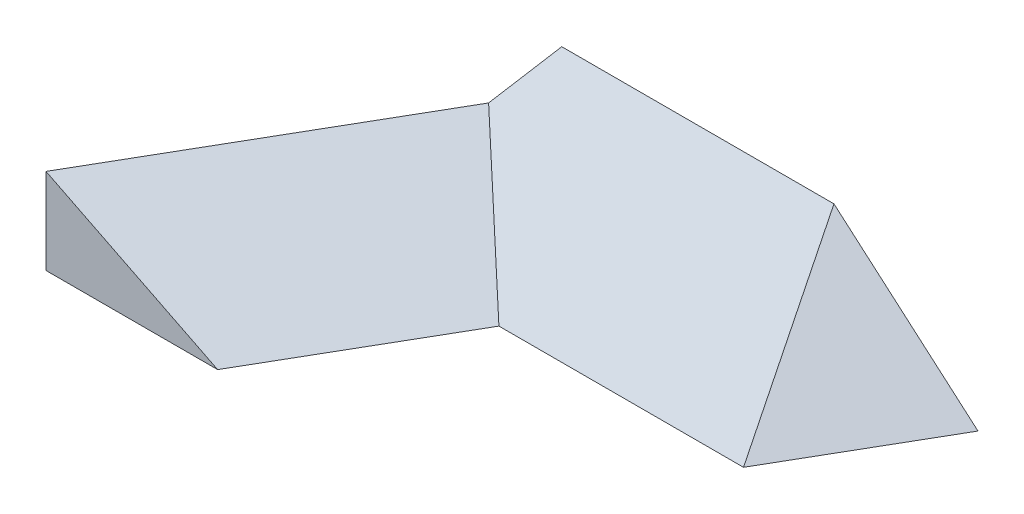
ISO-10303-21;
HEADER;
FILE_DESCRIPTION(('STEP AP214'),'2;1');
FILE_NAME('part.step','',(''),(''),'','','');
FILE_SCHEMA(('AUTOMOTIVE_DESIGN { 1 0 10303 214 1 1 1 1 }'));
ENDSEC;
DATA;
#1=APPLICATION_CONTEXT('core data for automotive mechanical design processes');
#2=APPLICATION_PROTOCOL_DEFINITION('international standard','automotive_design',2000,#1);
#3=PRODUCT_CONTEXT('',#1,'mechanical');
#4=PRODUCT('Part','Part','',(#3));
#5=PRODUCT_RELATED_PRODUCT_CATEGORY('part','',(#4));
#6=PRODUCT_DEFINITION_FORMATION('','',#4);
#7=PRODUCT_DEFINITION_CONTEXT('part definition',#1,'design');
#8=PRODUCT_DEFINITION('design','',#6,#7);
#9=PRODUCT_DEFINITION_SHAPE('','',#8);
#10=(LENGTH_UNIT() NAMED_UNIT(*) SI_UNIT(.MILLI.,.METRE.));
#11=(NAMED_UNIT(*) PLANE_ANGLE_UNIT() SI_UNIT($,.RADIAN.));
#12=(NAMED_UNIT(*) SI_UNIT($,.STERADIAN.) SOLID_ANGLE_UNIT());
#13=UNCERTAINTY_MEASURE_WITH_UNIT(LENGTH_MEASURE(1.E-05),#10,'distance_accuracy_value','');
#14=(GEOMETRIC_REPRESENTATION_CONTEXT(3) GLOBAL_UNCERTAINTY_ASSIGNED_CONTEXT((#13)) GLOBAL_UNIT_ASSIGNED_CONTEXT((#10,
#11,#12)) REPRESENTATION_CONTEXT('',''));
#15=CARTESIAN_POINT('',(0.,0.,0.));
#16=DIRECTION('',(0.,0.,1.));
#17=DIRECTION('',(1.,0.,0.));
#18=AXIS2_PLACEMENT_3D('',#15,#16,#17);
#19=CARTESIAN_POINT('',(-153.73,0.,50.));
#20=DIRECTION('',(0.,-1.,0.));
#21=DIRECTION('',(0.,0.,-1.));
#22=AXIS2_PLACEMENT_3D('',#19,#20,#21);
#23=PLANE('',#22);
#24=DIRECTION('',(-0.499999999999988,0.,0.866025403784445));
#25=VECTOR('',#24,1.);
#26=CARTESIAN_POINT('',(-96.6972594212497,0.,24.997453211524));
#27=LINE('',#26,#25);
#28=CARTESIAN_POINT('',(-111.132486540002,0.,50.));
#29=VERTEX_POINT('',#28);
#30=CARTESIAN_POINT('',(-145.758732339442,0.,109.974417));
#31=VERTEX_POINT('',#30);
#32=EDGE_CURVE('E97',#29,#31,#27,.T.);
#33=ORIENTED_EDGE('',*,*,#32,.T.);
#34=DIRECTION('',(-1.,0.,0.));
#35=VECTOR('',#34,1.);
#36=CARTESIAN_POINT('',(-203.840726,0.,109.974417));
#37=LINE('',#36,#35);
#38=CARTESIAN_POINT('',(-203.493759258401,0.,109.974417));
#39=VERTEX_POINT('',#38);
#40=EDGE_CURVE('E87',#31,#39,#37,.T.);
#41=ORIENTED_EDGE('',*,*,#40,.T.);
#42=DIRECTION('',(-0.499999999999988,0.,0.866025403784445));
#43=VECTOR('',#42,1.);
#44=CARTESIAN_POINT('',(-139.99852961047,0.,-0.00254678847425027));
#45=LINE('',#44,#43);
#46=CARTESIAN_POINT('',(-139.99852961047,0.,-0.00254678847425027));
#47=VERTEX_POINT('',#46);
#48=EDGE_CURVE('E107',#47,#39,#45,.T.);
#49=ORIENTED_EDGE('',*,*,#48,.F.);
#50=DIRECTION('',(0.866025403784446,0.,0.499999999999988));
#51=VECTOR('',#50,1.);
#52=CARTESIAN_POINT('',(-96.6972594212497,0.,24.997453211524));
#53=LINE('',#52,#51);
#54=CARTESIAN_POINT('',(-139.994118443436,0.,0.));
#55=VERTEX_POINT('',#54);
#56=EDGE_CURVE('E153',#47,#55,#53,.T.);
#57=ORIENTED_EDGE('',*,*,#56,.T.);
#58=DIRECTION('',(1.,0.,0.));
#59=VECTOR('',#58,1.);
#60=CARTESIAN_POINT('',(-153.73,0.,0.));
#61=LINE('',#60,#59);
#62=CARTESIAN_POINT('',(0.,0.,0.));
#63=VERTEX_POINT('',#62);
#64=EDGE_CURVE('E116',#55,#63,#61,.T.);
#65=ORIENTED_EDGE('',*,*,#64,.T.);
#66=DIRECTION('',(-0.500000000000004,0.,0.866025403784436));
#67=VECTOR('',#66,1.);
#68=CARTESIAN_POINT('',(1.13248654051865,0.,-1.9615242270662));
#69=LINE('',#68,#67);
#70=CARTESIAN_POINT('',(-28.8675134594816,0.,50.));
#71=VERTEX_POINT('',#70);
#72=EDGE_CURVE('E101',#63,#71,#69,.T.);
#73=ORIENTED_EDGE('',*,*,#72,.T.);
#74=DIRECTION('',(1.,0.,0.));
#75=VECTOR('',#74,1.);
#76=CARTESIAN_POINT('',(-153.73,0.,50.));
#77=LINE('',#76,#75);
#78=EDGE_CURVE('E106',#29,#71,#77,.T.);
#79=ORIENTED_EDGE('',*,*,#78,.F.);
#80=EDGE_LOOP('',(#33,#41,#49,#57,#65,#73,#79));
#81=FACE_BOUND('',#80,.T.);
#82=ADVANCED_FACE('F32',(#81),#23,.T.);
#83=CARTESIAN_POINT('',(-139.99852961047,28.8675134594795,-0.00254678847425027));
#84=DIRECTION('',(0.433012701892218,0.866025403784442,0.249999999999991));
#85=DIRECTION('',(-0.894427190999917,0.447213595499956,0.));
#86=AXIS2_PLACEMENT_3D('',#83,#84,#85);
#87=PLANE('',#86);
#88=DIRECTION('',(-0.499999999999988,0.,0.866025403784445));
#89=VECTOR('',#88,1.);
#90=CARTESIAN_POINT('',(-139.99852961047,28.8675134594795,-0.00254678847425027));
#91=LINE('',#90,#89);
#92=CARTESIAN_POINT('',(-149.004953582391,28.8675134594784,15.5970371254031));
#93=VERTEX_POINT('',#92);
#94=CARTESIAN_POINT('',(-203.493759258401,28.8675134594795,109.974417));
#95=VERTEX_POINT('',#94);
#96=EDGE_CURVE('E100',#93,#95,#91,.T.);
#97=ORIENTED_EDGE('',*,*,#96,.T.);
#98=DIRECTION('',(0.894427190999917,-0.447213595499956,0.));
#99=VECTOR('',#98,1.);
#100=CARTESIAN_POINT('',(-152.697575540056,3.46942160030711,109.974417));
#101=LINE('',#100,#99);
#102=EDGE_CURVE('E46',#95,#31,#101,.T.);
#103=ORIENTED_EDGE('',*,*,#102,.T.);
#104=ORIENTED_EDGE('',*,*,#32,.F.);
#105=DIRECTION('',(-0.644669634590924,0.49138624459402,-0.585611322346307));
#106=VECTOR('',#105,1.);
#107=CARTESIAN_POINT('',(-161.002833933721,38.0126523842695,4.69828495701149));
#108=LINE('',#107,#106);
#109=EDGE_CURVE('E114',#29,#93,#108,.T.);
#110=ORIENTED_EDGE('',*,*,#109,.T.);
#111=EDGE_LOOP('',(#97,#103,#104,#110));
#112=FACE_BOUND('',#111,.T.);
#113=ADVANCED_FACE('F95',(#112),#87,.T.);
#114=CARTESIAN_POINT('',(-139.99852961047,0.,-0.00254678847425027));
#115=DIRECTION('',(-0.866025403784445,0.,-0.499999999999988));
#116=DIRECTION('',(-0.499999999999988,0.,0.866025403784445));
#117=AXIS2_PLACEMENT_3D('',#114,#115,#116);
#118=PLANE('',#117);
#119=ORIENTED_EDGE('',*,*,#48,.T.);
#120=DIRECTION('',(0.,1.,0.));
#121=VECTOR('',#120,1.);
#122=CARTESIAN_POINT('',(-203.493759258401,0.,109.974417));
#123=LINE('',#122,#121);
#124=EDGE_CURVE('E11',#39,#95,#123,.T.);
#125=ORIENTED_EDGE('',*,*,#124,.T.);
#126=ORIENTED_EDGE('',*,*,#96,.F.);
#127=DIRECTION('',(-0.404481746652011,-0.58785888315255,0.700582935935479));
#128=VECTOR('',#127,1.);
#129=CARTESIAN_POINT('',(-142.246303286298,38.6902870396628,3.89071142198017));
#130=LINE('',#129,#128);
#131=CARTESIAN_POINT('',(-139.999999999609,41.9549815588635,2.25961610533787E-10));
#132=VERTEX_POINT('',#131);
#133=EDGE_CURVE('E145',#132,#93,#130,.T.);
#134=ORIENTED_EDGE('',*,*,#133,.F.);
#135=DIRECTION('',(0.,-1.,0.));
#136=VECTOR('',#135,1.);
#137=CARTESIAN_POINT('',(-139.999999999609,41.9549815588635,2.25961610533787E-10));
#138=LINE('',#137,#136);
#139=CARTESIAN_POINT('',(-139.999999999481,28.8675134594796,0.));
#140=VERTEX_POINT('',#139);
#141=EDGE_CURVE('E137',#132,#140,#138,.T.);
#142=ORIENTED_EDGE('',*,*,#141,.T.);
#143=CARTESIAN_POINT('',(-139.99852961047,28.8675134594795,-0.00254678847425027));
#144=VERTEX_POINT('',#143);
#145=EDGE_CURVE('E109',#144,#140,#91,.T.);
#146=ORIENTED_EDGE('',*,*,#145,.F.);
#147=DIRECTION('',(0.,-1.,0.));
#148=VECTOR('',#147,1.);
#149=CARTESIAN_POINT('',(-139.99852961047,0.,-0.00254678847425027));
#150=LINE('',#149,#148);
#151=EDGE_CURVE('E147',#144,#47,#150,.T.);
#152=ORIENTED_EDGE('',*,*,#151,.T.);
#153=EDGE_LOOP('',(#119,#125,#126,#134,#142,#146,#152));
#154=FACE_BOUND('',#153,.T.);
#155=ADVANCED_FACE('F157',(#154),#118,.T.);
#156=CARTESIAN_POINT('',(-153.73,41.9549815588635,0.));
#157=DIRECTION('',(0.,0.766044443118982,0.642787609686535));
#158=DIRECTION('',(0.,-0.642787609686535,0.766044443118982));
#159=AXIS2_PLACEMENT_3D('',#156,#157,#158);
#160=PLANE('',#159);
#161=DIRECTION('',(0.287305031663346,-0.615687131487935,0.733747350864779));
#162=VECTOR('',#161,1.);
#163=CARTESIAN_POINT('',(-57.1360676109505,60.5787685515489,-22.1949650562424));
#164=LINE('',#163,#162);
#165=CARTESIAN_POINT('',(-48.4454397937119,41.9549815588635,0.));
#166=VERTEX_POINT('',#165);
#167=EDGE_CURVE('E131',#166,#71,#164,.T.);
#168=ORIENTED_EDGE('',*,*,#167,.F.);
#169=DIRECTION('',(1.,0.,0.));
#170=VECTOR('',#169,1.);
#171=CARTESIAN_POINT('',(-153.73,41.9549815588635,0.));
#172=LINE('',#171,#170);
#173=EDGE_CURVE('E119',#132,#166,#172,.T.);
#174=ORIENTED_EDGE('',*,*,#173,.F.);
#175=ORIENTED_EDGE('',*,*,#133,.T.);
#176=ORIENTED_EDGE('',*,*,#109,.F.);
#177=ORIENTED_EDGE('',*,*,#78,.T.);
#178=EDGE_LOOP('',(#168,#174,#175,#176,#177));
#179=FACE_BOUND('',#178,.T.);
#180=ADVANCED_FACE('F136',(#179),#160,.T.);
#181=CARTESIAN_POINT('',(-153.73,0.,0.));
#182=DIRECTION('',(0.,0.,-1.));
#183=DIRECTION('',(-1.,0.,0.));
#184=AXIS2_PLACEMENT_3D('',#181,#182,#183);
#185=PLANE('',#184);
#186=DIRECTION('',(-0.755928946018459,0.654653670707972,0.));
#187=VECTOR('',#186,1.);
#188=CARTESIAN_POINT('',(-87.8457142857153,76.076620185018,0.));
#189=LINE('',#188,#187);
#190=EDGE_CURVE('E39',#63,#166,#189,.T.);
#191=ORIENTED_EDGE('',*,*,#190,.F.);
#192=ORIENTED_EDGE('',*,*,#64,.F.);
#193=DIRECTION('',(0.,1.,0.));
#194=VECTOR('',#193,1.);
#195=CARTESIAN_POINT('',(-139.994118443436,0.,0.));
#196=LINE('',#195,#194);
#197=CARTESIAN_POINT('',(-139.994118443436,28.8645726814572,0.));
#198=VERTEX_POINT('',#197);
#199=EDGE_CURVE('E118',#55,#198,#196,.T.);
#200=ORIENTED_EDGE('',*,*,#199,.T.);
#201=DIRECTION('',(0.894427190999917,-0.447213595499956,0.));
#202=VECTOR('',#201,1.);
#203=CARTESIAN_POINT('',(-139.436994616104,28.5860107677912,0.));
#204=LINE('',#203,#202);
#205=EDGE_CURVE('E126',#140,#198,#204,.T.);
#206=ORIENTED_EDGE('',*,*,#205,.F.);
#207=ORIENTED_EDGE('',*,*,#141,.F.);
#208=ORIENTED_EDGE('',*,*,#173,.T.);
#209=EDGE_LOOP('',(#191,#192,#200,#206,#207,#208));
#210=FACE_BOUND('',#209,.T.);
#211=ADVANCED_FACE('F140',(#210),#185,.T.);
#212=ORIENTED_EDGE('',*,*,#145,.T.);
#213=ORIENTED_EDGE('',*,*,#205,.T.);
#214=DIRECTION('',(-0.750000000000009,0.499999999999995,-0.43301270189221));
#215=VECTOR('',#214,1.);
#216=CARTESIAN_POINT('',(-139.99852961047,28.8675134594795,-0.00254678847425027));
#217=LINE('',#216,#215);
#218=EDGE_CURVE('E53',#198,#144,#217,.T.);
#219=ORIENTED_EDGE('',*,*,#218,.T.);
#220=EDGE_LOOP('',(#212,#213,#219));
#221=FACE_BOUND('',#220,.T.);
#222=ADVANCED_FACE('F156',(#221),#87,.T.);
#223=CARTESIAN_POINT('',(-139.99852961047,0.,-0.00254678847425027));
#224=DIRECTION('',(-0.499999999999988,0.,0.866025403784446));
#225=DIRECTION('',(0.866025403784446,0.,0.499999999999988));
#226=AXIS2_PLACEMENT_3D('',#223,#224,#225);
#227=PLANE('',#226);
#228=ORIENTED_EDGE('',*,*,#199,.F.);
#229=ORIENTED_EDGE('',*,*,#56,.F.);
#230=ORIENTED_EDGE('',*,*,#151,.F.);
#231=ORIENTED_EDGE('',*,*,#218,.F.);
#232=EDGE_LOOP('',(#228,#229,#230,#231));
#233=FACE_BOUND('',#232,.T.);
#234=ADVANCED_FACE('F159',(#233),#227,.F.);
#235=CARTESIAN_POINT('',(1.13248654051865,0.,-1.9615242270662));
#236=DIRECTION('',(-0.61237243569579,-0.707106781186551,-0.353553390593275));
#237=DIRECTION('',(0.755928946018459,-0.654653670707972,0.));
#238=AXIS2_PLACEMENT_3D('',#235,#236,#237);
#239=PLANE('',#238);
#240=ORIENTED_EDGE('',*,*,#167,.T.);
#241=ORIENTED_EDGE('',*,*,#72,.F.);
#242=ORIENTED_EDGE('',*,*,#190,.T.);
#243=EDGE_LOOP('',(#240,#241,#242));
#244=FACE_BOUND('',#243,.T.);
#245=ADVANCED_FACE('F130',(#244),#239,.F.);
#246=CARTESIAN_POINT('',(-203.840726,41.9549815588635,109.974417));
#247=DIRECTION('',(0.,0.,1.));
#248=DIRECTION('',(1.,0.,0.));
#249=AXIS2_PLACEMENT_3D('',#246,#247,#248);
#250=PLANE('',#249);
#251=ORIENTED_EDGE('',*,*,#124,.F.);
#252=ORIENTED_EDGE('',*,*,#40,.F.);
#253=ORIENTED_EDGE('',*,*,#102,.F.);
#254=EDGE_LOOP('',(#251,#252,#253));
#255=FACE_BOUND('',#254,.T.);
#256=ADVANCED_FACE('F88',(#255),#250,.T.);
#257=CLOSED_SHELL('',(#82,#113,#155,#180,#211,#222,#234,#245,#256));
#258=MANIFOLD_SOLID_BREP('B2',#257);
#259=ADVANCED_BREP_SHAPE_REPRESENTATION('',(#18,#258),#14);
#260=SHAPE_DEFINITION_REPRESENTATION(#9,#259);
ENDSEC;
END-ISO-10303-21;
